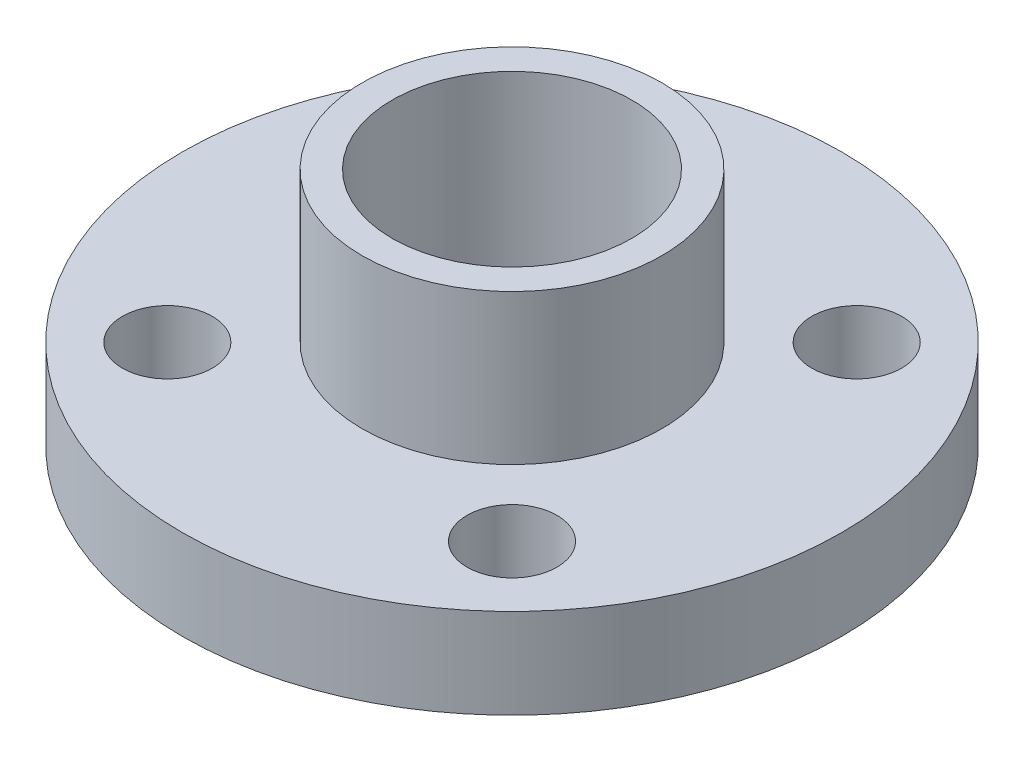
ISO-10303-21;
HEADER;
FILE_DESCRIPTION(('STEP AP214'),'2;1');
FILE_NAME('part.step','',(''),(''),'','','');
FILE_SCHEMA(('AUTOMOTIVE_DESIGN { 1 0 10303 214 1 1 1 1 }'));
ENDSEC;
DATA;
#1=APPLICATION_CONTEXT('core data for automotive mechanical design processes');
#2=APPLICATION_PROTOCOL_DEFINITION('international standard','automotive_design',2000,#1);
#3=PRODUCT_CONTEXT('',#1,'mechanical');
#4=PRODUCT('Part','Part','',(#3));
#5=PRODUCT_RELATED_PRODUCT_CATEGORY('part','',(#4));
#6=PRODUCT_DEFINITION_FORMATION('','',#4);
#7=PRODUCT_DEFINITION_CONTEXT('part definition',#1,'design');
#8=PRODUCT_DEFINITION('design','',#6,#7);
#9=PRODUCT_DEFINITION_SHAPE('','',#8);
#10=(LENGTH_UNIT() NAMED_UNIT(*) SI_UNIT(.MILLI.,.METRE.));
#11=(NAMED_UNIT(*) PLANE_ANGLE_UNIT() SI_UNIT($,.RADIAN.));
#12=(NAMED_UNIT(*) SI_UNIT($,.STERADIAN.) SOLID_ANGLE_UNIT());
#13=UNCERTAINTY_MEASURE_WITH_UNIT(LENGTH_MEASURE(1.E-05),#10,'distance_accuracy_value','');
#14=(GEOMETRIC_REPRESENTATION_CONTEXT(3) GLOBAL_UNCERTAINTY_ASSIGNED_CONTEXT((#13)) GLOBAL_UNIT_ASSIGNED_CONTEXT((#10,
#11,#12)) REPRESENTATION_CONTEXT('',''));
#15=CARTESIAN_POINT('',(0.,0.,0.));
#16=DIRECTION('',(0.,0.,1.));
#17=DIRECTION('',(1.,0.,0.));
#18=AXIS2_PLACEMENT_3D('',#15,#16,#17);
#19=CARTESIAN_POINT('',(0.,3.,0.));
#20=DIRECTION('',(0.,1.,0.));
#21=DIRECTION('',(0.,0.,1.));
#22=AXIS2_PLACEMENT_3D('',#19,#20,#21);
#23=PLANE('',#22);
#24=CARTESIAN_POINT('',(5.75000000000032,3.,5.74999999999968));
#25=DIRECTION('',(0.,1.,0.));
#26=DIRECTION('',(0.,0.,1.));
#27=AXIS2_PLACEMENT_3D('',#24,#25,#26);
#28=CIRCLE('',#27,1.5);
#29=CARTESIAN_POINT('',(5.75000000000032,3.,7.24999999999968));
#30=VERTEX_POINT('',#29);
#31=EDGE_CURVE('E60',#30,#30,#28,.T.);
#32=ORIENTED_EDGE('',*,*,#31,.F.);
#33=EDGE_LOOP('',(#32));
#34=FACE_BOUND('',#33,.T.);
#35=CARTESIAN_POINT('',(-5.75,3.,-5.75));
#36=DIRECTION('',(0.,1.,0.));
#37=DIRECTION('',(0.,0.,1.));
#38=AXIS2_PLACEMENT_3D('',#35,#36,#37);
#39=CIRCLE('',#38,1.5);
#40=CARTESIAN_POINT('',(-5.75,3.,-4.25));
#41=VERTEX_POINT('',#40);
#42=EDGE_CURVE('E50',#41,#41,#39,.T.);
#43=ORIENTED_EDGE('',*,*,#42,.F.);
#44=EDGE_LOOP('',(#43));
#45=FACE_BOUND('',#44,.T.);
#46=CARTESIAN_POINT('',(0.,3.,0.));
#47=DIRECTION('',(0.,1.,0.));
#48=DIRECTION('',(0.,0.,1.));
#49=AXIS2_PLACEMENT_3D('',#46,#47,#48);
#50=CIRCLE('',#49,11.);
#51=CARTESIAN_POINT('',(0.,3.,11.));
#52=VERTEX_POINT('',#51);
#53=EDGE_CURVE('E10',#52,#52,#50,.T.);
#54=ORIENTED_EDGE('',*,*,#53,.T.);
#55=EDGE_LOOP('',(#54));
#56=FACE_BOUND('',#55,.T.);
#57=CARTESIAN_POINT('',(0.,3.,0.));
#58=DIRECTION('',(0.,1.,0.));
#59=DIRECTION('',(0.,0.,1.));
#60=AXIS2_PLACEMENT_3D('',#57,#58,#59);
#61=CIRCLE('',#60,5.);
#62=CARTESIAN_POINT('',(0.,3.,5.));
#63=VERTEX_POINT('',#62);
#64=EDGE_CURVE('E46',#63,#63,#61,.T.);
#65=ORIENTED_EDGE('',*,*,#64,.F.);
#66=EDGE_LOOP('',(#65));
#67=FACE_BOUND('',#66,.T.);
#68=CARTESIAN_POINT('',(5.75,3.,-5.75000000000032));
#69=DIRECTION('',(0.,1.,0.));
#70=DIRECTION('',(0.,0.,1.));
#71=AXIS2_PLACEMENT_3D('',#68,#69,#70);
#72=CIRCLE('',#71,1.5);
#73=CARTESIAN_POINT('',(5.75,3.,-4.25000000000032));
#74=VERTEX_POINT('',#73);
#75=EDGE_CURVE('E54',#74,#74,#72,.T.);
#76=ORIENTED_EDGE('',*,*,#75,.F.);
#77=EDGE_LOOP('',(#76));
#78=FACE_BOUND('',#77,.T.);
#79=CARTESIAN_POINT('',(-5.74999999999968,3.,5.75));
#80=DIRECTION('',(0.,1.,0.));
#81=DIRECTION('',(0.,0.,1.));
#82=AXIS2_PLACEMENT_3D('',#79,#80,#81);
#83=CIRCLE('',#82,1.5);
#84=CARTESIAN_POINT('',(-5.74999999999968,3.,7.25));
#85=VERTEX_POINT('',#84);
#86=EDGE_CURVE('E66',#85,#85,#83,.T.);
#87=ORIENTED_EDGE('',*,*,#86,.F.);
#88=EDGE_LOOP('',(#87));
#89=FACE_BOUND('',#88,.T.);
#90=ADVANCED_FACE('F35',(#34,#45,#56,#67,#78,#89),#23,.T.);
#91=CARTESIAN_POINT('',(0.,0.,0.));
#92=DIRECTION('',(0.,1.,0.));
#93=DIRECTION('',(0.,0.,1.));
#94=AXIS2_PLACEMENT_3D('',#91,#92,#93);
#95=PLANE('',#94);
#96=CARTESIAN_POINT('',(0.,0.,0.));
#97=DIRECTION('',(0.,1.,0.));
#98=DIRECTION('',(0.,0.,1.));
#99=AXIS2_PLACEMENT_3D('',#96,#97,#98);
#100=CIRCLE('',#99,11.);
#101=CARTESIAN_POINT('',(0.,0.,11.));
#102=VERTEX_POINT('',#101);
#103=EDGE_CURVE('E39',#102,#102,#100,.T.);
#104=ORIENTED_EDGE('',*,*,#103,.F.);
#105=EDGE_LOOP('',(#104));
#106=FACE_BOUND('',#105,.T.);
#107=CARTESIAN_POINT('',(0.,0.,0.));
#108=DIRECTION('',(0.,1.,0.));
#109=DIRECTION('',(0.,0.,1.));
#110=AXIS2_PLACEMENT_3D('',#107,#108,#109);
#111=CIRCLE('',#110,5.);
#112=CARTESIAN_POINT('',(0.,0.,5.));
#113=VERTEX_POINT('',#112);
#114=EDGE_CURVE('E72',#113,#113,#111,.T.);
#115=ORIENTED_EDGE('',*,*,#114,.T.);
#116=EDGE_LOOP('',(#115));
#117=FACE_BOUND('',#116,.T.);
#118=CARTESIAN_POINT('',(-5.75,0.,-5.75));
#119=DIRECTION('',(0.,1.,0.));
#120=DIRECTION('',(0.,0.,1.));
#121=AXIS2_PLACEMENT_3D('',#118,#119,#120);
#122=CIRCLE('',#121,1.5);
#123=CARTESIAN_POINT('',(-5.75,0.,-4.25));
#124=VERTEX_POINT('',#123);
#125=EDGE_CURVE('E51',#124,#124,#122,.T.);
#126=ORIENTED_EDGE('',*,*,#125,.T.);
#127=EDGE_LOOP('',(#126));
#128=FACE_BOUND('',#127,.T.);
#129=CARTESIAN_POINT('',(5.75,0.,-5.75000000000032));
#130=DIRECTION('',(0.,1.,0.));
#131=DIRECTION('',(0.,0.,1.));
#132=AXIS2_PLACEMENT_3D('',#129,#130,#131);
#133=CIRCLE('',#132,1.5);
#134=CARTESIAN_POINT('',(5.75,0.,-4.25000000000032));
#135=VERTEX_POINT('',#134);
#136=EDGE_CURVE('E57',#135,#135,#133,.T.);
#137=ORIENTED_EDGE('',*,*,#136,.T.);
#138=EDGE_LOOP('',(#137));
#139=FACE_BOUND('',#138,.T.);
#140=CARTESIAN_POINT('',(5.75000000000032,0.,5.74999999999968));
#141=DIRECTION('',(0.,1.,0.));
#142=DIRECTION('',(0.,0.,1.));
#143=AXIS2_PLACEMENT_3D('',#140,#141,#142);
#144=CIRCLE('',#143,1.5);
#145=CARTESIAN_POINT('',(5.75000000000032,0.,7.24999999999968));
#146=VERTEX_POINT('',#145);
#147=EDGE_CURVE('E63',#146,#146,#144,.T.);
#148=ORIENTED_EDGE('',*,*,#147,.T.);
#149=EDGE_LOOP('',(#148));
#150=FACE_BOUND('',#149,.T.);
#151=CARTESIAN_POINT('',(-5.74999999999968,0.,5.75));
#152=DIRECTION('',(0.,1.,0.));
#153=DIRECTION('',(0.,0.,1.));
#154=AXIS2_PLACEMENT_3D('',#151,#152,#153);
#155=CIRCLE('',#154,1.5);
#156=CARTESIAN_POINT('',(-5.74999999999968,0.,7.25));
#157=VERTEX_POINT('',#156);
#158=EDGE_CURVE('E69',#157,#157,#155,.T.);
#159=ORIENTED_EDGE('',*,*,#158,.T.);
#160=EDGE_LOOP('',(#159));
#161=FACE_BOUND('',#160,.T.);
#162=ADVANCED_FACE('F103',(#106,#117,#128,#139,#150,#161),#95,.F.);
#163=CARTESIAN_POINT('',(0.,3.,0.));
#164=DIRECTION('',(0.,-1.,0.));
#165=DIRECTION('',(0.,0.,-1.));
#166=AXIS2_PLACEMENT_3D('',#163,#164,#165);
#167=CYLINDRICAL_SURFACE('',#166,11.);
#168=ORIENTED_EDGE('',*,*,#53,.F.);
#169=EDGE_LOOP('',(#168));
#170=FACE_BOUND('',#169,.T.);
#171=ORIENTED_EDGE('',*,*,#103,.T.);
#172=EDGE_LOOP('',(#171));
#173=FACE_BOUND('',#172,.T.);
#174=ADVANCED_FACE('F37',(#170,#173),#167,.T.);
#175=CARTESIAN_POINT('',(-5.75,3.,-5.75));
#176=DIRECTION('',(0.,-1.,0.));
#177=DIRECTION('',(0.,0.,-1.));
#178=AXIS2_PLACEMENT_3D('',#175,#176,#177);
#179=CYLINDRICAL_SURFACE('',#178,1.5);
#180=ORIENTED_EDGE('',*,*,#42,.T.);
#181=EDGE_LOOP('',(#180));
#182=FACE_BOUND('',#181,.T.);
#183=ORIENTED_EDGE('',*,*,#125,.F.);
#184=EDGE_LOOP('',(#183));
#185=FACE_BOUND('',#184,.T.);
#186=ADVANCED_FACE('F113',(#182,#185),#179,.F.);
#187=CARTESIAN_POINT('',(5.75,3.,-5.75000000000032));
#188=DIRECTION('',(0.,-1.,0.));
#189=DIRECTION('',(0.,0.,-1.));
#190=AXIS2_PLACEMENT_3D('',#187,#188,#189);
#191=CYLINDRICAL_SURFACE('',#190,1.5);
#192=ORIENTED_EDGE('',*,*,#75,.T.);
#193=EDGE_LOOP('',(#192));
#194=FACE_BOUND('',#193,.T.);
#195=ORIENTED_EDGE('',*,*,#136,.F.);
#196=EDGE_LOOP('',(#195));
#197=FACE_BOUND('',#196,.T.);
#198=ADVANCED_FACE('F116',(#194,#197),#191,.F.);
#199=CARTESIAN_POINT('',(5.75000000000032,3.,5.74999999999968));
#200=DIRECTION('',(0.,-1.,0.));
#201=DIRECTION('',(0.,0.,-1.));
#202=AXIS2_PLACEMENT_3D('',#199,#200,#201);
#203=CYLINDRICAL_SURFACE('',#202,1.5);
#204=ORIENTED_EDGE('',*,*,#31,.T.);
#205=EDGE_LOOP('',(#204));
#206=FACE_BOUND('',#205,.T.);
#207=ORIENTED_EDGE('',*,*,#147,.F.);
#208=EDGE_LOOP('',(#207));
#209=FACE_BOUND('',#208,.T.);
#210=ADVANCED_FACE('F120',(#206,#209),#203,.F.);
#211=CARTESIAN_POINT('',(-5.74999999999968,3.,5.75));
#212=DIRECTION('',(0.,-1.,0.));
#213=DIRECTION('',(0.,0.,-1.));
#214=AXIS2_PLACEMENT_3D('',#211,#212,#213);
#215=CYLINDRICAL_SURFACE('',#214,1.5);
#216=ORIENTED_EDGE('',*,*,#86,.T.);
#217=EDGE_LOOP('',(#216));
#218=FACE_BOUND('',#217,.T.);
#219=ORIENTED_EDGE('',*,*,#158,.F.);
#220=EDGE_LOOP('',(#219));
#221=FACE_BOUND('',#220,.T.);
#222=ADVANCED_FACE('F124',(#218,#221),#215,.F.);
#223=CARTESIAN_POINT('',(0.,-2.,0.));
#224=DIRECTION('',(0.,1.,0.));
#225=DIRECTION('',(0.,0.,1.));
#226=AXIS2_PLACEMENT_3D('',#223,#224,#225);
#227=CYLINDRICAL_SURFACE('',#226,5.);
#228=CARTESIAN_POINT('',(0.,-2.,0.));
#229=DIRECTION('',(0.,1.,0.));
#230=DIRECTION('',(0.,0.,1.));
#231=AXIS2_PLACEMENT_3D('',#228,#229,#230);
#232=CIRCLE('',#231,5.);
#233=CARTESIAN_POINT('',(0.,-2.,5.));
#234=VERTEX_POINT('',#233);
#235=EDGE_CURVE('E77',#234,#234,#232,.T.);
#236=ORIENTED_EDGE('',*,*,#235,.T.);
#237=EDGE_LOOP('',(#236));
#238=FACE_BOUND('',#237,.T.);
#239=ORIENTED_EDGE('',*,*,#114,.F.);
#240=EDGE_LOOP('',(#239));
#241=FACE_BOUND('',#240,.T.);
#242=ADVANCED_FACE('F128',(#238,#241),#227,.T.);
#243=ORIENTED_EDGE('',*,*,#64,.T.);
#244=EDGE_LOOP('',(#243));
#245=FACE_BOUND('',#244,.T.);
#246=CARTESIAN_POINT('',(0.,8.,0.));
#247=DIRECTION('',(0.,1.,0.));
#248=DIRECTION('',(0.,0.,1.));
#249=AXIS2_PLACEMENT_3D('',#246,#247,#248);
#250=CIRCLE('',#249,5.);
#251=CARTESIAN_POINT('',(0.,8.,5.));
#252=VERTEX_POINT('',#251);
#253=EDGE_CURVE('E83',#252,#252,#250,.T.);
#254=ORIENTED_EDGE('',*,*,#253,.F.);
#255=EDGE_LOOP('',(#254));
#256=FACE_BOUND('',#255,.T.);
#257=ADVANCED_FACE('F130',(#245,#256),#227,.T.);
#258=CARTESIAN_POINT('',(0.,-2.,0.));
#259=DIRECTION('',(0.,1.,0.));
#260=DIRECTION('',(0.,0.,1.));
#261=AXIS2_PLACEMENT_3D('',#258,#259,#260);
#262=PLANE('',#261);
#263=CARTESIAN_POINT('',(0.,-2.,0.));
#264=DIRECTION('',(0.,1.,0.));
#265=DIRECTION('',(0.,0.,1.));
#266=AXIS2_PLACEMENT_3D('',#263,#264,#265);
#267=CIRCLE('',#266,4.);
#268=CARTESIAN_POINT('',(0.,-2.,4.));
#269=VERTEX_POINT('',#268);
#270=EDGE_CURVE('E80',#269,#269,#267,.T.);
#271=ORIENTED_EDGE('',*,*,#270,.T.);
#272=EDGE_LOOP('',(#271));
#273=FACE_BOUND('',#272,.T.);
#274=ORIENTED_EDGE('',*,*,#235,.F.);
#275=EDGE_LOOP('',(#274));
#276=FACE_BOUND('',#275,.T.);
#277=ADVANCED_FACE('F99',(#273,#276),#262,.F.);
#278=CARTESIAN_POINT('',(0.,-2.,0.));
#279=DIRECTION('',(0.,1.,0.));
#280=DIRECTION('',(0.,0.,1.));
#281=AXIS2_PLACEMENT_3D('',#278,#279,#280);
#282=CYLINDRICAL_SURFACE('',#281,4.);
#283=ORIENTED_EDGE('',*,*,#270,.F.);
#284=EDGE_LOOP('',(#283));
#285=FACE_BOUND('',#284,.T.);
#286=CARTESIAN_POINT('',(0.,8.,0.));
#287=DIRECTION('',(0.,1.,0.));
#288=DIRECTION('',(0.,0.,1.));
#289=AXIS2_PLACEMENT_3D('',#286,#287,#288);
#290=CIRCLE('',#289,4.);
#291=CARTESIAN_POINT('',(0.,8.,4.));
#292=VERTEX_POINT('',#291);
#293=EDGE_CURVE('E86',#292,#292,#290,.T.);
#294=ORIENTED_EDGE('',*,*,#293,.T.);
#295=EDGE_LOOP('',(#294));
#296=FACE_BOUND('',#295,.T.);
#297=ADVANCED_FACE('F90',(#285,#296),#282,.F.);
#298=CARTESIAN_POINT('',(0.,8.,0.));
#299=DIRECTION('',(0.,1.,0.));
#300=DIRECTION('',(0.,0.,1.));
#301=AXIS2_PLACEMENT_3D('',#298,#299,#300);
#302=PLANE('',#301);
#303=ORIENTED_EDGE('',*,*,#253,.T.);
#304=EDGE_LOOP('',(#303));
#305=FACE_BOUND('',#304,.T.);
#306=ORIENTED_EDGE('',*,*,#293,.F.);
#307=EDGE_LOOP('',(#306));
#308=FACE_BOUND('',#307,.T.);
#309=ADVANCED_FACE('F92',(#305,#308),#302,.T.);
#310=CLOSED_SHELL('',(#90,#162,#174,#186,#198,#210,#222,#242,#257,#277,#297,#309));
#311=MANIFOLD_SOLID_BREP('B2',#310);
#312=ADVANCED_BREP_SHAPE_REPRESENTATION('',(#18,#311),#14);
#313=SHAPE_DEFINITION_REPRESENTATION(#9,#312);
ENDSEC;
END-ISO-10303-21;
